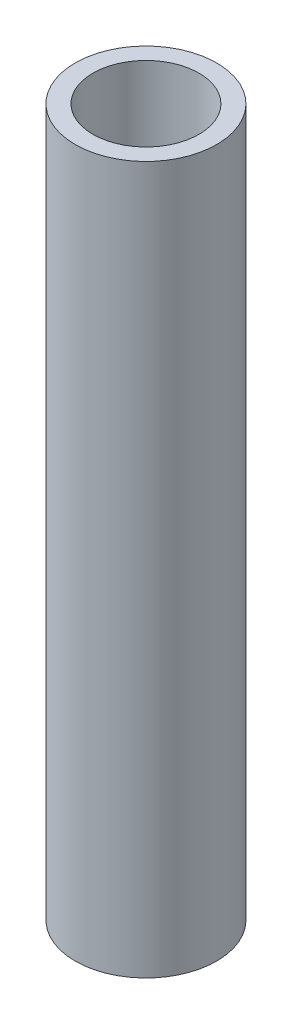
ISO-10303-21;
HEADER;
FILE_DESCRIPTION(('STEP AP214'),'2;1');
FILE_NAME('part.step','',(''),(''),'','','');
FILE_SCHEMA(('AUTOMOTIVE_DESIGN { 1 0 10303 214 1 1 1 1 }'));
ENDSEC;
DATA;
#1=APPLICATION_CONTEXT('core data for automotive mechanical design processes');
#2=APPLICATION_PROTOCOL_DEFINITION('international standard','automotive_design',2000,#1);
#3=PRODUCT_CONTEXT('',#1,'mechanical');
#4=PRODUCT('Part','Part','',(#3));
#5=PRODUCT_RELATED_PRODUCT_CATEGORY('part','',(#4));
#6=PRODUCT_DEFINITION_FORMATION('','',#4);
#7=PRODUCT_DEFINITION_CONTEXT('part definition',#1,'design');
#8=PRODUCT_DEFINITION('design','',#6,#7);
#9=PRODUCT_DEFINITION_SHAPE('','',#8);
#10=(LENGTH_UNIT() NAMED_UNIT(*) SI_UNIT(.MILLI.,.METRE.));
#11=(NAMED_UNIT(*) PLANE_ANGLE_UNIT() SI_UNIT($,.RADIAN.));
#12=(NAMED_UNIT(*) SI_UNIT($,.STERADIAN.) SOLID_ANGLE_UNIT());
#13=UNCERTAINTY_MEASURE_WITH_UNIT(LENGTH_MEASURE(1.E-05),#10,'distance_accuracy_value','');
#14=(GEOMETRIC_REPRESENTATION_CONTEXT(3) GLOBAL_UNCERTAINTY_ASSIGNED_CONTEXT((#13)) GLOBAL_UNIT_ASSIGNED_CONTEXT((#10,
#11,#12)) REPRESENTATION_CONTEXT('',''));
#15=CARTESIAN_POINT('',(0.,0.,0.));
#16=DIRECTION('',(0.,0.,1.));
#17=DIRECTION('',(1.,0.,0.));
#18=AXIS2_PLACEMENT_3D('',#15,#16,#17);
#19=CARTESIAN_POINT('',(0.,200.,0.));
#20=DIRECTION('',(0.,1.,0.));
#21=DIRECTION('',(0.,0.,1.));
#22=AXIS2_PLACEMENT_3D('',#19,#20,#21);
#23=PLANE('',#22);
#24=CARTESIAN_POINT('',(0.,200.,0.));
#25=DIRECTION('',(0.,1.,0.));
#26=DIRECTION('',(0.,0.,1.));
#27=AXIS2_PLACEMENT_3D('',#24,#25,#26);
#28=CIRCLE('',#27,20.);
#29=CARTESIAN_POINT('',(0.,200.,20.));
#30=VERTEX_POINT('',#29);
#31=EDGE_CURVE('E10',#30,#30,#28,.T.);
#32=ORIENTED_EDGE('',*,*,#31,.T.);
#33=EDGE_LOOP('',(#32));
#34=FACE_BOUND('',#33,.T.);
#35=CARTESIAN_POINT('',(0.,200.,0.));
#36=DIRECTION('',(0.,1.,0.));
#37=DIRECTION('',(0.,0.,1.));
#38=AXIS2_PLACEMENT_3D('',#35,#36,#37);
#39=CIRCLE('',#38,15.);
#40=CARTESIAN_POINT('',(0.,200.,15.));
#41=VERTEX_POINT('',#40);
#42=EDGE_CURVE('E47',#41,#41,#39,.T.);
#43=ORIENTED_EDGE('',*,*,#42,.F.);
#44=EDGE_LOOP('',(#43));
#45=FACE_BOUND('',#44,.T.);
#46=ADVANCED_FACE('F36',(#34,#45),#23,.T.);
#47=CARTESIAN_POINT('',(0.,0.,0.));
#48=DIRECTION('',(0.,1.,0.));
#49=DIRECTION('',(0.,0.,1.));
#50=AXIS2_PLACEMENT_3D('',#47,#48,#49);
#51=PLANE('',#50);
#52=CARTESIAN_POINT('',(0.,0.,0.));
#53=DIRECTION('',(0.,1.,0.));
#54=DIRECTION('',(0.,0.,1.));
#55=AXIS2_PLACEMENT_3D('',#52,#53,#54);
#56=CIRCLE('',#55,20.);
#57=CARTESIAN_POINT('',(0.,0.,20.));
#58=VERTEX_POINT('',#57);
#59=EDGE_CURVE('E40',#58,#58,#56,.T.);
#60=ORIENTED_EDGE('',*,*,#59,.F.);
#61=EDGE_LOOP('',(#60));
#62=FACE_BOUND('',#61,.T.);
#63=CARTESIAN_POINT('',(0.,0.,0.));
#64=DIRECTION('',(0.,1.,0.));
#65=DIRECTION('',(0.,0.,1.));
#66=AXIS2_PLACEMENT_3D('',#63,#64,#65);
#67=CIRCLE('',#66,15.);
#68=CARTESIAN_POINT('',(0.,0.,15.));
#69=VERTEX_POINT('',#68);
#70=EDGE_CURVE('E49',#69,#69,#67,.T.);
#71=ORIENTED_EDGE('',*,*,#70,.T.);
#72=EDGE_LOOP('',(#71));
#73=FACE_BOUND('',#72,.T.);
#74=ADVANCED_FACE('F59',(#62,#73),#51,.F.);
#75=CARTESIAN_POINT('',(0.,200.,0.));
#76=DIRECTION('',(0.,-1.,0.));
#77=DIRECTION('',(0.,0.,-1.));
#78=AXIS2_PLACEMENT_3D('',#75,#76,#77);
#79=CYLINDRICAL_SURFACE('',#78,20.);
#80=ORIENTED_EDGE('',*,*,#31,.F.);
#81=EDGE_LOOP('',(#80));
#82=FACE_BOUND('',#81,.T.);
#83=ORIENTED_EDGE('',*,*,#59,.T.);
#84=EDGE_LOOP('',(#83));
#85=FACE_BOUND('',#84,.T.);
#86=ADVANCED_FACE('F38',(#82,#85),#79,.T.);
#87=CARTESIAN_POINT('',(0.,200.,0.));
#88=DIRECTION('',(0.,-1.,0.));
#89=DIRECTION('',(0.,0.,-1.));
#90=AXIS2_PLACEMENT_3D('',#87,#88,#89);
#91=CYLINDRICAL_SURFACE('',#90,15.);
#92=ORIENTED_EDGE('',*,*,#42,.T.);
#93=EDGE_LOOP('',(#92));
#94=FACE_BOUND('',#93,.T.);
#95=ORIENTED_EDGE('',*,*,#70,.F.);
#96=EDGE_LOOP('',(#95));
#97=FACE_BOUND('',#96,.T.);
#98=ADVANCED_FACE('F55',(#94,#97),#91,.F.);
#99=CLOSED_SHELL('',(#46,#74,#86,#98));
#100=MANIFOLD_SOLID_BREP('B2',#99);
#101=ADVANCED_BREP_SHAPE_REPRESENTATION('',(#18,#100),#14);
#102=SHAPE_DEFINITION_REPRESENTATION(#9,#101);
ENDSEC;
END-ISO-10303-21;
